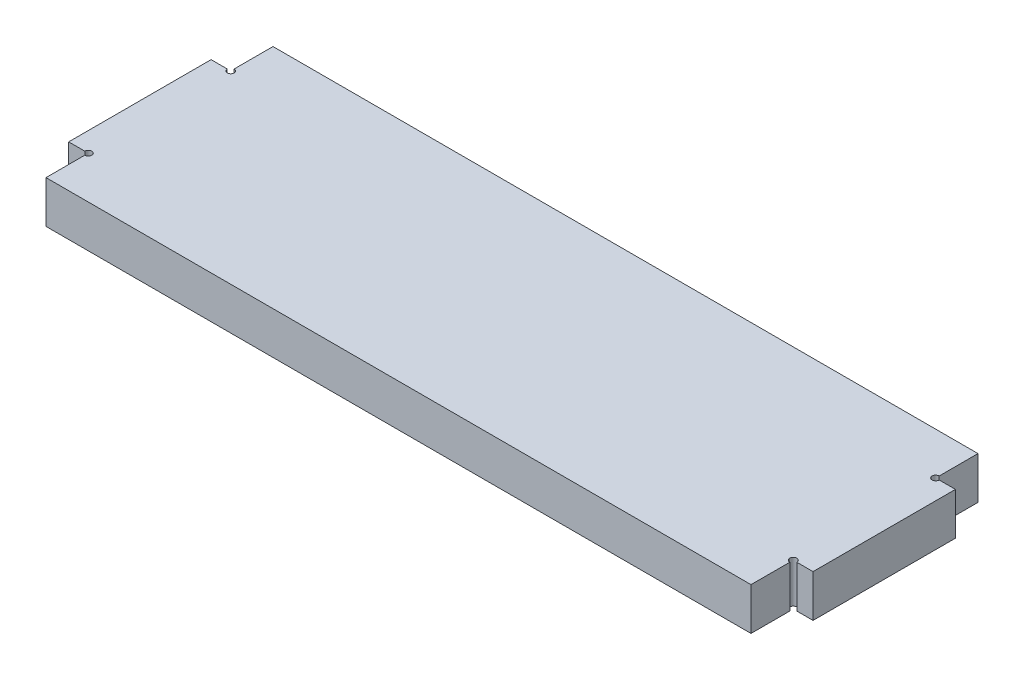
ISO-10303-21;
HEADER;
FILE_DESCRIPTION(('STEP AP214'),'2;1');
FILE_NAME('part.step','',(''),(''),'','','');
FILE_SCHEMA(('AUTOMOTIVE_DESIGN { 1 0 10303 214 1 1 1 1 }'));
ENDSEC;
DATA;
#1=APPLICATION_CONTEXT('core data for automotive mechanical design processes');
#2=APPLICATION_PROTOCOL_DEFINITION('international standard','automotive_design',2000,#1);
#3=PRODUCT_CONTEXT('',#1,'mechanical');
#4=PRODUCT('Part','Part','',(#3));
#5=PRODUCT_RELATED_PRODUCT_CATEGORY('part','',(#4));
#6=PRODUCT_DEFINITION_FORMATION('','',#4);
#7=PRODUCT_DEFINITION_CONTEXT('part definition',#1,'design');
#8=PRODUCT_DEFINITION('design','',#6,#7);
#9=PRODUCT_DEFINITION_SHAPE('','',#8);
#10=(LENGTH_UNIT() NAMED_UNIT(*) SI_UNIT(.MILLI.,.METRE.));
#11=(NAMED_UNIT(*) PLANE_ANGLE_UNIT() SI_UNIT($,.RADIAN.));
#12=(NAMED_UNIT(*) SI_UNIT($,.STERADIAN.) SOLID_ANGLE_UNIT());
#13=UNCERTAINTY_MEASURE_WITH_UNIT(LENGTH_MEASURE(1.E-05),#10,'distance_accuracy_value','');
#14=(GEOMETRIC_REPRESENTATION_CONTEXT(3) GLOBAL_UNCERTAINTY_ASSIGNED_CONTEXT((#13)) GLOBAL_UNIT_ASSIGNED_CONTEXT((#10,
#11,#12)) REPRESENTATION_CONTEXT('',''));
#15=CARTESIAN_POINT('',(0.,0.,0.));
#16=DIRECTION('',(0.,0.,1.));
#17=DIRECTION('',(1.,0.,0.));
#18=AXIS2_PLACEMENT_3D('',#15,#16,#17);
#19=CARTESIAN_POINT('',(0.,3.,-5.58212290502793));
#20=DIRECTION('',(-1.,0.,0.));
#21=DIRECTION('',(0.,0.,1.));
#22=AXIS2_PLACEMENT_3D('',#19,#20,#21);
#23=PLANE('',#22);
#24=DIRECTION('',(0.,0.,-1.));
#25=VECTOR('',#24,1.);
#26=CARTESIAN_POINT('',(0.,0.,-5.58212290502793));
#27=LINE('',#26,#25);
#28=CARTESIAN_POINT('',(0.,0.,-5.58212290502793));
#29=VERTEX_POINT('',#28);
#30=CARTESIAN_POINT('',(0.,0.,-8.33212290502794));
#31=VERTEX_POINT('',#30);
#32=EDGE_CURVE('E178',#29,#31,#27,.T.);
#33=ORIENTED_EDGE('',*,*,#32,.T.);
#34=DIRECTION('',(0.,-1.,0.));
#35=VECTOR('',#34,1.);
#36=CARTESIAN_POINT('',(0.,3.,-8.33212290502794));
#37=LINE('',#36,#35);
#38=CARTESIAN_POINT('',(0.,3.,-8.33212290502794));
#39=VERTEX_POINT('',#38);
#40=EDGE_CURVE('E11',#39,#31,#37,.T.);
#41=ORIENTED_EDGE('',*,*,#40,.F.);
#42=DIRECTION('',(0.,0.,-1.));
#43=VECTOR('',#42,1.);
#44=CARTESIAN_POINT('',(0.,3.,-5.58212290502793));
#45=LINE('',#44,#43);
#46=CARTESIAN_POINT('',(0.,3.,-5.58212290502793));
#47=VERTEX_POINT('',#46);
#48=EDGE_CURVE('E221',#47,#39,#45,.T.);
#49=ORIENTED_EDGE('',*,*,#48,.F.);
#50=DIRECTION('',(0.,-1.,0.));
#51=VECTOR('',#50,1.);
#52=CARTESIAN_POINT('',(0.,3.,-5.58212290502793));
#53=LINE('',#52,#51);
#54=EDGE_CURVE('E49',#47,#29,#53,.T.);
#55=ORIENTED_EDGE('',*,*,#54,.T.);
#56=EDGE_LOOP('',(#33,#41,#49,#55));
#57=FACE_BOUND('',#56,.T.);
#58=ADVANCED_FACE('F33',(#57),#23,.F.);
#59=CARTESIAN_POINT('',(0.,3.,-8.33212290502794));
#60=DIRECTION('',(0.,0.,1.));
#61=DIRECTION('',(1.,0.,0.));
#62=AXIS2_PLACEMENT_3D('',#59,#60,#61);
#63=PLANE('',#62);
#64=DIRECTION('',(-1.,0.,0.));
#65=VECTOR('',#64,1.);
#66=CARTESIAN_POINT('',(0.,0.,-8.33212290502794));
#67=LINE('',#66,#65);
#68=CARTESIAN_POINT('',(-50.,0.,-8.33212290502793));
#69=VERTEX_POINT('',#68);
#70=EDGE_CURVE('E180',#31,#69,#67,.T.);
#71=ORIENTED_EDGE('',*,*,#70,.T.);
#72=DIRECTION('',(0.,-1.,0.));
#73=VECTOR('',#72,1.);
#74=CARTESIAN_POINT('',(-50.,3.,-8.33212290502793));
#75=LINE('',#74,#73);
#76=CARTESIAN_POINT('',(-50.,3.,-8.33212290502793));
#77=VERTEX_POINT('',#76);
#78=EDGE_CURVE('E41',#77,#69,#75,.T.);
#79=ORIENTED_EDGE('',*,*,#78,.F.);
#80=DIRECTION('',(-1.,0.,0.));
#81=VECTOR('',#80,1.);
#82=CARTESIAN_POINT('',(0.,3.,-8.33212290502794));
#83=LINE('',#82,#81);
#84=EDGE_CURVE('E111',#39,#77,#83,.T.);
#85=ORIENTED_EDGE('',*,*,#84,.F.);
#86=ORIENTED_EDGE('',*,*,#40,.T.);
#87=EDGE_LOOP('',(#71,#79,#85,#86));
#88=FACE_BOUND('',#87,.T.);
#89=ADVANCED_FACE('F302',(#88),#63,.F.);
#90=CARTESIAN_POINT('',(-50.,3.,-8.33212290502793));
#91=DIRECTION('',(1.,0.,0.));
#92=DIRECTION('',(0.,0.,-1.));
#93=AXIS2_PLACEMENT_3D('',#90,#91,#92);
#94=PLANE('',#93);
#95=DIRECTION('',(0.,0.,1.));
#96=VECTOR('',#95,1.);
#97=CARTESIAN_POINT('',(-50.,0.,-8.33212290502793));
#98=LINE('',#97,#96);
#99=CARTESIAN_POINT('',(-50.,0.,-5.57738217807717));
#100=VERTEX_POINT('',#99);
#101=EDGE_CURVE('E182',#69,#100,#98,.T.);
#102=ORIENTED_EDGE('',*,*,#101,.T.);
#103=DIRECTION('',(0.,-1.,0.));
#104=VECTOR('',#103,1.);
#105=CARTESIAN_POINT('',(-50.,3.,-5.57738217807717));
#106=LINE('',#105,#104);
#107=CARTESIAN_POINT('',(-50.,3.,-5.57738217807717));
#108=VERTEX_POINT('',#107);
#109=EDGE_CURVE('E243',#108,#100,#106,.T.);
#110=ORIENTED_EDGE('',*,*,#109,.F.);
#111=DIRECTION('',(0.,0.,1.));
#112=VECTOR('',#111,1.);
#113=CARTESIAN_POINT('',(-50.,3.,-8.33212290502793));
#114=LINE('',#113,#112);
#115=EDGE_CURVE('E250',#77,#108,#114,.T.);
#116=ORIENTED_EDGE('',*,*,#115,.F.);
#117=ORIENTED_EDGE('',*,*,#78,.T.);
#118=EDGE_LOOP('',(#102,#110,#116,#117));
#119=FACE_BOUND('',#118,.T.);
#120=ADVANCED_FACE('F248',(#119),#94,.F.);
#121=CARTESIAN_POINT('',(-50.,3.,-5.33212290502793));
#122=DIRECTION('',(0.,-1.,0.));
#123=DIRECTION('',(0.,0.,-1.));
#124=AXIS2_PLACEMENT_3D('',#121,#122,#123);
#125=CYLINDRICAL_SURFACE('',#124,0.245259273049241);
#126=CARTESIAN_POINT('',(-50.,0.,-5.33212290502793));
#127=DIRECTION('',(0.,1.,0.));
#128=DIRECTION('',(0.,0.,1.));
#129=AXIS2_PLACEMENT_3D('',#126,#127,#128);
#130=CIRCLE('',#129,0.245259273049241);
#131=CARTESIAN_POINT('',(-50.2452592730492,0.,-5.33212290502793));
#132=VERTEX_POINT('',#131);
#133=EDGE_CURVE('E185',#132,#100,#130,.T.);
#134=ORIENTED_EDGE('',*,*,#133,.F.);
#135=DIRECTION('',(0.,-1.,0.));
#136=VECTOR('',#135,1.);
#137=CARTESIAN_POINT('',(-50.2452592730492,3.,-5.33212290502793));
#138=LINE('',#137,#136);
#139=CARTESIAN_POINT('',(-50.2452592730492,3.,-5.33212290502793));
#140=VERTEX_POINT('',#139);
#141=EDGE_CURVE('E241',#140,#132,#138,.T.);
#142=ORIENTED_EDGE('',*,*,#141,.F.);
#143=CARTESIAN_POINT('',(-50.,3.,-5.33212290502793));
#144=DIRECTION('',(0.,1.,0.));
#145=DIRECTION('',(0.,0.,1.));
#146=AXIS2_PLACEMENT_3D('',#143,#144,#145);
#147=CIRCLE('',#146,0.245259273049241);
#148=EDGE_CURVE('E260',#140,#108,#147,.T.);
#149=ORIENTED_EDGE('',*,*,#148,.T.);
#150=ORIENTED_EDGE('',*,*,#109,.T.);
#151=EDGE_LOOP('',(#134,#142,#149,#150));
#152=FACE_BOUND('',#151,.T.);
#153=ADVANCED_FACE('F256',(#152),#125,.F.);
#154=CARTESIAN_POINT('',(-50.2452592730492,3.,-5.33212290502793));
#155=DIRECTION('',(0.,0.,1.));
#156=DIRECTION('',(1.,0.,0.));
#157=AXIS2_PLACEMENT_3D('',#154,#155,#156);
#158=PLANE('',#157);
#159=DIRECTION('',(-1.,0.,0.));
#160=VECTOR('',#159,1.);
#161=CARTESIAN_POINT('',(-50.2452592730492,0.,-5.33212290502793));
#162=LINE('',#161,#160);
#163=CARTESIAN_POINT('',(-51.3909816227561,0.,-5.33212290502793));
#164=VERTEX_POINT('',#163);
#165=EDGE_CURVE('E188',#132,#164,#162,.T.);
#166=ORIENTED_EDGE('',*,*,#165,.T.);
#167=DIRECTION('',(0.,-1.,0.));
#168=VECTOR('',#167,1.);
#169=CARTESIAN_POINT('',(-51.3909816227561,3.,-5.33212290502793));
#170=LINE('',#169,#168);
#171=CARTESIAN_POINT('',(-51.3909816227561,3.,-5.33212290502793));
#172=VERTEX_POINT('',#171);
#173=EDGE_CURVE('E239',#172,#164,#170,.T.);
#174=ORIENTED_EDGE('',*,*,#173,.F.);
#175=DIRECTION('',(-1.,0.,0.));
#176=VECTOR('',#175,1.);
#177=CARTESIAN_POINT('',(-50.2452592730492,3.,-5.33212290502793));
#178=LINE('',#177,#176);
#179=EDGE_CURVE('E261',#140,#172,#178,.T.);
#180=ORIENTED_EDGE('',*,*,#179,.F.);
#181=ORIENTED_EDGE('',*,*,#141,.T.);
#182=EDGE_LOOP('',(#166,#174,#180,#181));
#183=FACE_BOUND('',#182,.T.);
#184=ADVANCED_FACE('F315',(#183),#158,.F.);
#185=CARTESIAN_POINT('',(-51.3909816227561,3.,4.76787709497207));
#186=DIRECTION('',(-1.,0.,0.));
#187=DIRECTION('',(0.,0.,1.));
#188=AXIS2_PLACEMENT_3D('',#185,#186,#187);
#189=PLANE('',#188);
#190=DIRECTION('',(0.,0.,-1.));
#191=VECTOR('',#190,1.);
#192=CARTESIAN_POINT('',(-51.3909816227561,0.,4.76787709497207));
#193=LINE('',#192,#191);
#194=CARTESIAN_POINT('',(-51.3909816227561,0.,4.76787709497207));
#195=VERTEX_POINT('',#194);
#196=EDGE_CURVE('E191',#195,#164,#193,.T.);
#197=ORIENTED_EDGE('',*,*,#196,.F.);
#198=DIRECTION('',(0.,-1.,0.));
#199=VECTOR('',#198,1.);
#200=CARTESIAN_POINT('',(-51.3909816227561,3.,4.76787709497207));
#201=LINE('',#200,#199);
#202=CARTESIAN_POINT('',(-51.3909816227561,3.,4.76787709497207));
#203=VERTEX_POINT('',#202);
#204=EDGE_CURVE('E237',#203,#195,#201,.T.);
#205=ORIENTED_EDGE('',*,*,#204,.F.);
#206=DIRECTION('',(0.,0.,-1.));
#207=VECTOR('',#206,1.);
#208=CARTESIAN_POINT('',(-51.3909816227561,3.,4.76787709497207));
#209=LINE('',#208,#207);
#210=EDGE_CURVE('E263',#203,#172,#209,.T.);
#211=ORIENTED_EDGE('',*,*,#210,.T.);
#212=ORIENTED_EDGE('',*,*,#173,.T.);
#213=EDGE_LOOP('',(#197,#205,#211,#212));
#214=FACE_BOUND('',#213,.T.);
#215=ADVANCED_FACE('F318',(#214),#189,.T.);
#216=CARTESIAN_POINT('',(-50.25,3.,4.76787709497207));
#217=DIRECTION('',(0.,0.,1.));
#218=DIRECTION('',(1.,0.,0.));
#219=AXIS2_PLACEMENT_3D('',#216,#217,#218);
#220=PLANE('',#219);
#221=DIRECTION('',(-1.,0.,0.));
#222=VECTOR('',#221,1.);
#223=CARTESIAN_POINT('',(-50.25,0.,4.76787709497207));
#224=LINE('',#223,#222);
#225=CARTESIAN_POINT('',(-50.25,0.,4.76787709497207));
#226=VERTEX_POINT('',#225);
#227=EDGE_CURVE('E194',#226,#195,#224,.T.);
#228=ORIENTED_EDGE('',*,*,#227,.F.);
#229=DIRECTION('',(0.,-1.,0.));
#230=VECTOR('',#229,1.);
#231=CARTESIAN_POINT('',(-50.25,3.,4.76787709497207));
#232=LINE('',#231,#230);
#233=CARTESIAN_POINT('',(-50.25,3.,4.76787709497207));
#234=VERTEX_POINT('',#233);
#235=EDGE_CURVE('E235',#234,#226,#232,.T.);
#236=ORIENTED_EDGE('',*,*,#235,.F.);
#237=DIRECTION('',(-1.,0.,0.));
#238=VECTOR('',#237,1.);
#239=CARTESIAN_POINT('',(-50.25,3.,4.76787709497207));
#240=LINE('',#239,#238);
#241=EDGE_CURVE('E270',#234,#203,#240,.T.);
#242=ORIENTED_EDGE('',*,*,#241,.T.);
#243=ORIENTED_EDGE('',*,*,#204,.T.);
#244=EDGE_LOOP('',(#228,#236,#242,#243));
#245=FACE_BOUND('',#244,.T.);
#246=ADVANCED_FACE('F322',(#245),#220,.T.);
#247=CARTESIAN_POINT('',(-50.,3.,4.76787709497207));
#248=DIRECTION('',(0.,-1.,0.));
#249=DIRECTION('',(0.,0.,-1.));
#250=AXIS2_PLACEMENT_3D('',#247,#248,#249);
#251=CYLINDRICAL_SURFACE('',#250,0.25);
#252=CARTESIAN_POINT('',(-50.,0.,4.76787709497207));
#253=DIRECTION('',(0.,1.,0.));
#254=DIRECTION('',(0.,0.,1.));
#255=AXIS2_PLACEMENT_3D('',#252,#253,#254);
#256=CIRCLE('',#255,0.25);
#257=CARTESIAN_POINT('',(-50.,0.,5.01787709497207));
#258=VERTEX_POINT('',#257);
#259=EDGE_CURVE('E197',#258,#226,#256,.T.);
#260=ORIENTED_EDGE('',*,*,#259,.F.);
#261=DIRECTION('',(0.,-1.,0.));
#262=VECTOR('',#261,1.);
#263=CARTESIAN_POINT('',(-50.,3.,5.01787709497207));
#264=LINE('',#263,#262);
#265=CARTESIAN_POINT('',(-50.,3.,5.01787709497207));
#266=VERTEX_POINT('',#265);
#267=EDGE_CURVE('E233',#266,#258,#264,.T.);
#268=ORIENTED_EDGE('',*,*,#267,.F.);
#269=CARTESIAN_POINT('',(-50.,3.,4.76787709497207));
#270=DIRECTION('',(0.,1.,0.));
#271=DIRECTION('',(0.,0.,1.));
#272=AXIS2_PLACEMENT_3D('',#269,#270,#271);
#273=CIRCLE('',#272,0.25);
#274=EDGE_CURVE('E273',#266,#234,#273,.T.);
#275=ORIENTED_EDGE('',*,*,#274,.T.);
#276=ORIENTED_EDGE('',*,*,#235,.T.);
#277=EDGE_LOOP('',(#260,#268,#275,#276));
#278=FACE_BOUND('',#277,.T.);
#279=ADVANCED_FACE('F326',(#278),#251,.F.);
#280=CARTESIAN_POINT('',(-50.,3.,7.76787709497207));
#281=DIRECTION('',(-1.,0.,0.));
#282=DIRECTION('',(0.,0.,1.));
#283=AXIS2_PLACEMENT_3D('',#280,#281,#282);
#284=PLANE('',#283);
#285=DIRECTION('',(0.,0.,-1.));
#286=VECTOR('',#285,1.);
#287=CARTESIAN_POINT('',(-50.,0.,7.76787709497207));
#288=LINE('',#287,#286);
#289=CARTESIAN_POINT('',(-50.,0.,7.76787709497207));
#290=VERTEX_POINT('',#289);
#291=EDGE_CURVE('E200',#290,#258,#288,.T.);
#292=ORIENTED_EDGE('',*,*,#291,.F.);
#293=DIRECTION('',(0.,-1.,0.));
#294=VECTOR('',#293,1.);
#295=CARTESIAN_POINT('',(-50.,3.,7.76787709497207));
#296=LINE('',#295,#294);
#297=CARTESIAN_POINT('',(-50.,3.,7.76787709497207));
#298=VERTEX_POINT('',#297);
#299=EDGE_CURVE('E231',#298,#290,#296,.T.);
#300=ORIENTED_EDGE('',*,*,#299,.F.);
#301=DIRECTION('',(0.,0.,-1.));
#302=VECTOR('',#301,1.);
#303=CARTESIAN_POINT('',(-50.,3.,7.76787709497207));
#304=LINE('',#303,#302);
#305=EDGE_CURVE('E276',#298,#266,#304,.T.);
#306=ORIENTED_EDGE('',*,*,#305,.T.);
#307=ORIENTED_EDGE('',*,*,#267,.T.);
#308=EDGE_LOOP('',(#292,#300,#306,#307));
#309=FACE_BOUND('',#308,.T.);
#310=ADVANCED_FACE('F330',(#309),#284,.T.);
#311=CARTESIAN_POINT('',(0.,3.,7.76787709497207));
#312=DIRECTION('',(0.,0.,1.));
#313=DIRECTION('',(1.,0.,0.));
#314=AXIS2_PLACEMENT_3D('',#311,#312,#313);
#315=PLANE('',#314);
#316=DIRECTION('',(-1.,0.,0.));
#317=VECTOR('',#316,1.);
#318=CARTESIAN_POINT('',(0.,0.,7.76787709497207));
#319=LINE('',#318,#317);
#320=CARTESIAN_POINT('',(0.,0.,7.76787709497207));
#321=VERTEX_POINT('',#320);
#322=EDGE_CURVE('E203',#321,#290,#319,.T.);
#323=ORIENTED_EDGE('',*,*,#322,.F.);
#324=DIRECTION('',(0.,-1.,0.));
#325=VECTOR('',#324,1.);
#326=CARTESIAN_POINT('',(0.,3.,7.76787709497207));
#327=LINE('',#326,#325);
#328=CARTESIAN_POINT('',(0.,3.,7.76787709497207));
#329=VERTEX_POINT('',#328);
#330=EDGE_CURVE('E229',#329,#321,#327,.T.);
#331=ORIENTED_EDGE('',*,*,#330,.F.);
#332=DIRECTION('',(-1.,0.,0.));
#333=VECTOR('',#332,1.);
#334=CARTESIAN_POINT('',(0.,3.,7.76787709497207));
#335=LINE('',#334,#333);
#336=EDGE_CURVE('E279',#329,#298,#335,.T.);
#337=ORIENTED_EDGE('',*,*,#336,.T.);
#338=ORIENTED_EDGE('',*,*,#299,.T.);
#339=EDGE_LOOP('',(#323,#331,#337,#338));
#340=FACE_BOUND('',#339,.T.);
#341=ADVANCED_FACE('F334',(#340),#315,.T.);
#342=CARTESIAN_POINT('',(0.,3.,5.01787709497207));
#343=DIRECTION('',(1.,0.,0.));
#344=DIRECTION('',(0.,0.,-1.));
#345=AXIS2_PLACEMENT_3D('',#342,#343,#344);
#346=PLANE('',#345);
#347=DIRECTION('',(0.,0.,1.));
#348=VECTOR('',#347,1.);
#349=CARTESIAN_POINT('',(0.,0.,5.01787709497207));
#350=LINE('',#349,#348);
#351=CARTESIAN_POINT('',(0.,0.,5.01787709497207));
#352=VERTEX_POINT('',#351);
#353=EDGE_CURVE('E206',#352,#321,#350,.T.);
#354=ORIENTED_EDGE('',*,*,#353,.F.);
#355=DIRECTION('',(0.,-1.,0.));
#356=VECTOR('',#355,1.);
#357=CARTESIAN_POINT('',(0.,3.,5.01787709497207));
#358=LINE('',#357,#356);
#359=CARTESIAN_POINT('',(0.,3.,5.01787709497207));
#360=VERTEX_POINT('',#359);
#361=EDGE_CURVE('E227',#360,#352,#358,.T.);
#362=ORIENTED_EDGE('',*,*,#361,.F.);
#363=DIRECTION('',(0.,0.,1.));
#364=VECTOR('',#363,1.);
#365=CARTESIAN_POINT('',(0.,3.,5.01787709497207));
#366=LINE('',#365,#364);
#367=EDGE_CURVE('E282',#360,#329,#366,.T.);
#368=ORIENTED_EDGE('',*,*,#367,.T.);
#369=ORIENTED_EDGE('',*,*,#330,.T.);
#370=EDGE_LOOP('',(#354,#362,#368,#369));
#371=FACE_BOUND('',#370,.T.);
#372=ADVANCED_FACE('F338',(#371),#346,.T.);
#373=CARTESIAN_POINT('',(0.,3.,4.76787709497207));
#374=DIRECTION('',(0.,-1.,0.));
#375=DIRECTION('',(0.,0.,-1.));
#376=AXIS2_PLACEMENT_3D('',#373,#374,#375);
#377=CYLINDRICAL_SURFACE('',#376,0.25);
#378=CARTESIAN_POINT('',(0.,0.,4.76787709497207));
#379=DIRECTION('',(0.,1.,0.));
#380=DIRECTION('',(0.,0.,1.));
#381=AXIS2_PLACEMENT_3D('',#378,#379,#380);
#382=CIRCLE('',#381,0.25);
#383=CARTESIAN_POINT('',(0.25,0.,4.76787709497207));
#384=VERTEX_POINT('',#383);
#385=EDGE_CURVE('E209',#384,#352,#382,.T.);
#386=ORIENTED_EDGE('',*,*,#385,.F.);
#387=DIRECTION('',(0.,-1.,0.));
#388=VECTOR('',#387,1.);
#389=CARTESIAN_POINT('',(0.25,3.,4.76787709497207));
#390=LINE('',#389,#388);
#391=CARTESIAN_POINT('',(0.25,3.,4.76787709497207));
#392=VERTEX_POINT('',#391);
#393=EDGE_CURVE('E225',#392,#384,#390,.T.);
#394=ORIENTED_EDGE('',*,*,#393,.F.);
#395=CARTESIAN_POINT('',(0.,3.,4.76787709497207));
#396=DIRECTION('',(0.,1.,0.));
#397=DIRECTION('',(0.,0.,1.));
#398=AXIS2_PLACEMENT_3D('',#395,#396,#397);
#399=CIRCLE('',#398,0.25);
#400=EDGE_CURVE('E285',#392,#360,#399,.T.);
#401=ORIENTED_EDGE('',*,*,#400,.T.);
#402=ORIENTED_EDGE('',*,*,#361,.T.);
#403=EDGE_LOOP('',(#386,#394,#401,#402));
#404=FACE_BOUND('',#403,.T.);
#405=ADVANCED_FACE('F342',(#404),#377,.F.);
#406=CARTESIAN_POINT('',(1.4,3.,4.76787709497207));
#407=DIRECTION('',(0.,0.,1.));
#408=DIRECTION('',(1.,0.,0.));
#409=AXIS2_PLACEMENT_3D('',#406,#407,#408);
#410=PLANE('',#409);
#411=DIRECTION('',(-1.,0.,0.));
#412=VECTOR('',#411,1.);
#413=CARTESIAN_POINT('',(1.4,0.,4.76787709497207));
#414=LINE('',#413,#412);
#415=CARTESIAN_POINT('',(1.4,0.,4.76787709497207));
#416=VERTEX_POINT('',#415);
#417=EDGE_CURVE('E212',#416,#384,#414,.T.);
#418=ORIENTED_EDGE('',*,*,#417,.F.);
#419=DIRECTION('',(0.,-1.,0.));
#420=VECTOR('',#419,1.);
#421=CARTESIAN_POINT('',(1.4,3.,4.76787709497207));
#422=LINE('',#421,#420);
#423=CARTESIAN_POINT('',(1.4,3.,4.76787709497207));
#424=VERTEX_POINT('',#423);
#425=EDGE_CURVE('E160',#424,#416,#422,.T.);
#426=ORIENTED_EDGE('',*,*,#425,.F.);
#427=DIRECTION('',(-1.,0.,0.));
#428=VECTOR('',#427,1.);
#429=CARTESIAN_POINT('',(1.4,3.,4.76787709497207));
#430=LINE('',#429,#428);
#431=EDGE_CURVE('E170',#424,#392,#430,.T.);
#432=ORIENTED_EDGE('',*,*,#431,.T.);
#433=ORIENTED_EDGE('',*,*,#393,.T.);
#434=EDGE_LOOP('',(#418,#426,#432,#433));
#435=FACE_BOUND('',#434,.T.);
#436=ADVANCED_FACE('F289',(#435),#410,.T.);
#437=CARTESIAN_POINT('',(1.4,3.,-5.33212290502793));
#438=DIRECTION('',(1.,0.,0.));
#439=DIRECTION('',(0.,0.,-1.));
#440=AXIS2_PLACEMENT_3D('',#437,#438,#439);
#441=PLANE('',#440);
#442=DIRECTION('',(0.,0.,1.));
#443=VECTOR('',#442,1.);
#444=CARTESIAN_POINT('',(1.4,0.,-5.33212290502793));
#445=LINE('',#444,#443);
#446=CARTESIAN_POINT('',(1.4,0.,-5.33212290502793));
#447=VERTEX_POINT('',#446);
#448=EDGE_CURVE('E156',#447,#416,#445,.T.);
#449=ORIENTED_EDGE('',*,*,#448,.F.);
#450=DIRECTION('',(0.,-1.,0.));
#451=VECTOR('',#450,1.);
#452=CARTESIAN_POINT('',(1.4,3.,-5.33212290502793));
#453=LINE('',#452,#451);
#454=CARTESIAN_POINT('',(1.4,3.,-5.33212290502793));
#455=VERTEX_POINT('',#454);
#456=EDGE_CURVE('E151',#455,#447,#453,.T.);
#457=ORIENTED_EDGE('',*,*,#456,.F.);
#458=DIRECTION('',(0.,0.,1.));
#459=VECTOR('',#458,1.);
#460=CARTESIAN_POINT('',(1.4,3.,-5.33212290502793));
#461=LINE('',#460,#459);
#462=EDGE_CURVE('E154',#455,#424,#461,.T.);
#463=ORIENTED_EDGE('',*,*,#462,.T.);
#464=ORIENTED_EDGE('',*,*,#425,.T.);
#465=EDGE_LOOP('',(#449,#457,#463,#464));
#466=FACE_BOUND('',#465,.T.);
#467=ADVANCED_FACE('F153',(#466),#441,.T.);
#468=CARTESIAN_POINT('',(0.25,3.,-5.33212290502793));
#469=DIRECTION('',(0.,0.,-1.));
#470=DIRECTION('',(-1.,0.,0.));
#471=AXIS2_PLACEMENT_3D('',#468,#469,#470);
#472=PLANE('',#471);
#473=DIRECTION('',(1.,0.,0.));
#474=VECTOR('',#473,1.);
#475=CARTESIAN_POINT('',(0.25,0.,-5.33212290502793));
#476=LINE('',#475,#474);
#477=CARTESIAN_POINT('',(0.25,0.,-5.33212290502793));
#478=VERTEX_POINT('',#477);
#479=EDGE_CURVE('E216',#478,#447,#476,.T.);
#480=ORIENTED_EDGE('',*,*,#479,.F.);
#481=DIRECTION('',(0.,-1.,0.));
#482=VECTOR('',#481,1.);
#483=CARTESIAN_POINT('',(0.25,3.,-5.33212290502793));
#484=LINE('',#483,#482);
#485=CARTESIAN_POINT('',(0.25,3.,-5.33212290502793));
#486=VERTEX_POINT('',#485);
#487=EDGE_CURVE('E99',#486,#478,#484,.T.);
#488=ORIENTED_EDGE('',*,*,#487,.F.);
#489=DIRECTION('',(1.,0.,0.));
#490=VECTOR('',#489,1.);
#491=CARTESIAN_POINT('',(0.25,3.,-5.33212290502793));
#492=LINE('',#491,#490);
#493=EDGE_CURVE('E167',#486,#455,#492,.T.);
#494=ORIENTED_EDGE('',*,*,#493,.T.);
#495=ORIENTED_EDGE('',*,*,#456,.T.);
#496=EDGE_LOOP('',(#480,#488,#494,#495));
#497=FACE_BOUND('',#496,.T.);
#498=ADVANCED_FACE('F172',(#497),#472,.T.);
#499=CARTESIAN_POINT('',(0.,3.,-5.33212290502793));
#500=DIRECTION('',(0.,-1.,0.));
#501=DIRECTION('',(0.,0.,-1.));
#502=AXIS2_PLACEMENT_3D('',#499,#500,#501);
#503=CYLINDRICAL_SURFACE('',#502,0.25);
#504=CARTESIAN_POINT('',(0.,0.,-5.33212290502793));
#505=DIRECTION('',(0.,1.,0.));
#506=DIRECTION('',(0.,0.,1.));
#507=AXIS2_PLACEMENT_3D('',#504,#505,#506);
#508=CIRCLE('',#507,0.25);
#509=EDGE_CURVE('E218',#29,#478,#508,.T.);
#510=ORIENTED_EDGE('',*,*,#509,.F.);
#511=ORIENTED_EDGE('',*,*,#54,.F.);
#512=CARTESIAN_POINT('',(0.,3.,-5.33212290502793));
#513=DIRECTION('',(0.,1.,0.));
#514=DIRECTION('',(0.,0.,1.));
#515=AXIS2_PLACEMENT_3D('',#512,#513,#514);
#516=CIRCLE('',#515,0.25);
#517=EDGE_CURVE('E173',#47,#486,#516,.T.);
#518=ORIENTED_EDGE('',*,*,#517,.T.);
#519=ORIENTED_EDGE('',*,*,#487,.T.);
#520=EDGE_LOOP('',(#510,#511,#518,#519));
#521=FACE_BOUND('',#520,.T.);
#522=ADVANCED_FACE('F291',(#521),#503,.F.);
#523=CARTESIAN_POINT('',(-50.,3.,-5.33212290502793));
#524=DIRECTION('',(0.,1.,0.));
#525=DIRECTION('',(0.,0.,1.));
#526=AXIS2_PLACEMENT_3D('',#523,#524,#525);
#527=PLANE('',#526);
#528=ORIENTED_EDGE('',*,*,#48,.T.);
#529=ORIENTED_EDGE('',*,*,#84,.T.);
#530=ORIENTED_EDGE('',*,*,#115,.T.);
#531=ORIENTED_EDGE('',*,*,#148,.F.);
#532=ORIENTED_EDGE('',*,*,#179,.T.);
#533=ORIENTED_EDGE('',*,*,#210,.F.);
#534=ORIENTED_EDGE('',*,*,#241,.F.);
#535=ORIENTED_EDGE('',*,*,#274,.F.);
#536=ORIENTED_EDGE('',*,*,#305,.F.);
#537=ORIENTED_EDGE('',*,*,#336,.F.);
#538=ORIENTED_EDGE('',*,*,#367,.F.);
#539=ORIENTED_EDGE('',*,*,#400,.F.);
#540=ORIENTED_EDGE('',*,*,#431,.F.);
#541=ORIENTED_EDGE('',*,*,#462,.F.);
#542=ORIENTED_EDGE('',*,*,#493,.F.);
#543=ORIENTED_EDGE('',*,*,#517,.F.);
#544=EDGE_LOOP('',(#528,#529,#530,#531,#532,#533,#534,#535,#536,#537,#538,#539,#540,#541,#542,#543));
#545=FACE_BOUND('',#544,.T.);
#546=ADVANCED_FACE('F165',(#545),#527,.T.);
#547=CARTESIAN_POINT('',(-50.,0.,-5.33212290502793));
#548=DIRECTION('',(0.,1.,0.));
#549=DIRECTION('',(0.,0.,1.));
#550=AXIS2_PLACEMENT_3D('',#547,#548,#549);
#551=PLANE('',#550);
#552=ORIENTED_EDGE('',*,*,#32,.F.);
#553=ORIENTED_EDGE('',*,*,#509,.T.);
#554=ORIENTED_EDGE('',*,*,#479,.T.);
#555=ORIENTED_EDGE('',*,*,#448,.T.);
#556=ORIENTED_EDGE('',*,*,#417,.T.);
#557=ORIENTED_EDGE('',*,*,#385,.T.);
#558=ORIENTED_EDGE('',*,*,#353,.T.);
#559=ORIENTED_EDGE('',*,*,#322,.T.);
#560=ORIENTED_EDGE('',*,*,#291,.T.);
#561=ORIENTED_EDGE('',*,*,#259,.T.);
#562=ORIENTED_EDGE('',*,*,#227,.T.);
#563=ORIENTED_EDGE('',*,*,#196,.T.);
#564=ORIENTED_EDGE('',*,*,#165,.F.);
#565=ORIENTED_EDGE('',*,*,#133,.T.);
#566=ORIENTED_EDGE('',*,*,#101,.F.);
#567=ORIENTED_EDGE('',*,*,#70,.F.);
#568=EDGE_LOOP('',(#552,#553,#554,#555,#556,#557,#558,#559,#560,#561,#562,#563,#564,#565,#566,#567));
#569=FACE_BOUND('',#568,.T.);
#570=ADVANCED_FACE('F252',(#569),#551,.F.);
#571=CLOSED_SHELL('',(#58,#89,#120,#153,#184,#215,#246,#279,#310,#341,#372,#405,#436,#467,#498,
#522,#546,#570));
#572=MANIFOLD_SOLID_BREP('B2',#571);
#573=ADVANCED_BREP_SHAPE_REPRESENTATION('',(#18,#572),#14);
#574=SHAPE_DEFINITION_REPRESENTATION(#9,#573);
ENDSEC;
END-ISO-10303-21;
